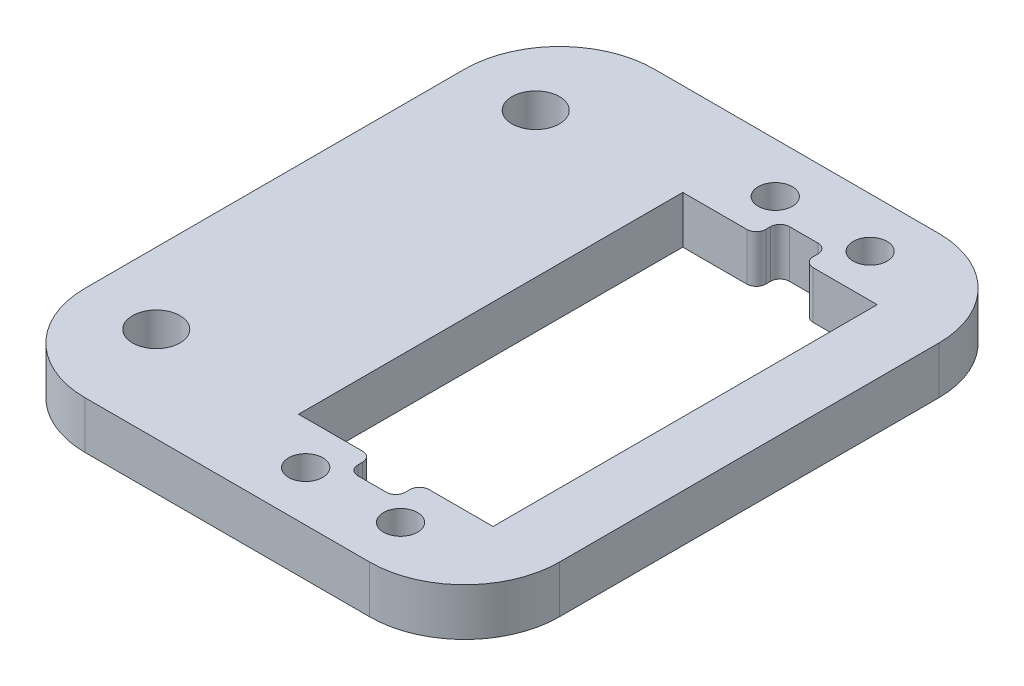
ISO-10303-21;
HEADER;
FILE_DESCRIPTION(('STEP AP214'),'2;1');
FILE_NAME('part.step','',(''),(''),'','','');
FILE_SCHEMA(('AUTOMOTIVE_DESIGN { 1 0 10303 214 1 1 1 1 }'));
ENDSEC;
DATA;
#1=APPLICATION_CONTEXT('core data for automotive mechanical design processes');
#2=APPLICATION_PROTOCOL_DEFINITION('international standard','automotive_design',2000,#1);
#3=PRODUCT_CONTEXT('',#1,'mechanical');
#4=PRODUCT('Part','Part','',(#3));
#5=PRODUCT_RELATED_PRODUCT_CATEGORY('part','',(#4));
#6=PRODUCT_DEFINITION_FORMATION('','',#4);
#7=PRODUCT_DEFINITION_CONTEXT('part definition',#1,'design');
#8=PRODUCT_DEFINITION('design','',#6,#7);
#9=PRODUCT_DEFINITION_SHAPE('','',#8);
#10=(LENGTH_UNIT() NAMED_UNIT(*) SI_UNIT(.MILLI.,.METRE.));
#11=(NAMED_UNIT(*) PLANE_ANGLE_UNIT() SI_UNIT($,.RADIAN.));
#12=(NAMED_UNIT(*) SI_UNIT($,.STERADIAN.) SOLID_ANGLE_UNIT());
#13=UNCERTAINTY_MEASURE_WITH_UNIT(LENGTH_MEASURE(1.E-05),#10,'distance_accuracy_value','');
#14=(GEOMETRIC_REPRESENTATION_CONTEXT(3) GLOBAL_UNCERTAINTY_ASSIGNED_CONTEXT((#13)) GLOBAL_UNIT_ASSIGNED_CONTEXT((#10,
#11,#12)) REPRESENTATION_CONTEXT('',''));
#15=CARTESIAN_POINT('',(0.,0.,0.));
#16=DIRECTION('',(0.,0.,1.));
#17=DIRECTION('',(1.,0.,0.));
#18=AXIS2_PLACEMENT_3D('',#15,#16,#17);
#19=CARTESIAN_POINT('',(0.,5.,0.));
#20=DIRECTION('',(0.,1.,0.));
#21=DIRECTION('',(0.,0.,1.));
#22=AXIS2_PLACEMENT_3D('',#19,#20,#21);
#23=PLANE('',#22);
#24=CARTESIAN_POINT('',(-17.5,5.,-20.));
#25=DIRECTION('',(0.,1.,0.));
#26=DIRECTION('',(0.,0.,1.));
#27=AXIS2_PLACEMENT_3D('',#24,#25,#26);
#28=CIRCLE('',#27,2.5);
#29=CARTESIAN_POINT('',(-17.5,5.,-17.5));
#30=VERTEX_POINT('',#29);
#31=EDGE_CURVE('E435',#30,#30,#28,.T.);
#32=ORIENTED_EDGE('',*,*,#31,.F.);
#33=EDGE_LOOP('',(#32));
#34=FACE_BOUND('',#33,.T.);
#35=CARTESIAN_POINT('',(-17.5,5.,20.));
#36=DIRECTION('',(0.,1.,0.));
#37=DIRECTION('',(0.,0.,1.));
#38=AXIS2_PLACEMENT_3D('',#35,#36,#37);
#39=CIRCLE('',#38,2.5);
#40=CARTESIAN_POINT('',(-17.5,5.,22.5));
#41=VERTEX_POINT('',#40);
#42=EDGE_CURVE('E423',#41,#41,#39,.T.);
#43=ORIENTED_EDGE('',*,*,#42,.F.);
#44=EDGE_LOOP('',(#43));
#45=FACE_BOUND('',#44,.T.);
#46=CARTESIAN_POINT('',(3.,5.,24.75));
#47=DIRECTION('',(0.,1.,0.));
#48=DIRECTION('',(0.,0.,-1.));
#49=AXIS2_PLACEMENT_3D('',#46,#47,#48);
#50=CIRCLE('',#49,1.8);
#51=CARTESIAN_POINT('',(3.,5.,22.95));
#52=VERTEX_POINT('',#51);
#53=EDGE_CURVE('E434',#52,#52,#50,.T.);
#54=ORIENTED_EDGE('',*,*,#53,.F.);
#55=EDGE_LOOP('',(#54));
#56=FACE_BOUND('',#55,.T.);
#57=CARTESIAN_POINT('',(13.,5.,24.75));
#58=DIRECTION('',(0.,1.,0.));
#59=DIRECTION('',(0.,0.,-1.));
#60=AXIS2_PLACEMENT_3D('',#57,#58,#59);
#61=CIRCLE('',#60,1.8);
#62=CARTESIAN_POINT('',(13.,5.,22.95));
#63=VERTEX_POINT('',#62);
#64=EDGE_CURVE('E449',#63,#63,#61,.T.);
#65=ORIENTED_EDGE('',*,*,#64,.F.);
#66=EDGE_LOOP('',(#65));
#67=FACE_BOUND('',#66,.T.);
#68=CARTESIAN_POINT('',(13.,5.,-24.75));
#69=DIRECTION('',(0.,1.,0.));
#70=DIRECTION('',(0.,0.,1.));
#71=AXIS2_PLACEMENT_3D('',#68,#69,#70);
#72=CIRCLE('',#71,1.8);
#73=CARTESIAN_POINT('',(13.,5.,-22.95));
#74=VERTEX_POINT('',#73);
#75=EDGE_CURVE('E443',#74,#74,#72,.T.);
#76=ORIENTED_EDGE('',*,*,#75,.F.);
#77=EDGE_LOOP('',(#76));
#78=FACE_BOUND('',#77,.T.);
#79=CARTESIAN_POINT('',(3.,5.,-24.75));
#80=DIRECTION('',(0.,1.,0.));
#81=DIRECTION('',(0.,0.,1.));
#82=AXIS2_PLACEMENT_3D('',#79,#80,#81);
#83=CIRCLE('',#82,1.8);
#84=CARTESIAN_POINT('',(3.,5.,-22.95));
#85=VERTEX_POINT('',#84);
#86=EDGE_CURVE('E251',#85,#85,#83,.T.);
#87=ORIENTED_EDGE('',*,*,#86,.F.);
#88=EDGE_LOOP('',(#87));
#89=FACE_BOUND('',#88,.T.);
#90=DIRECTION('',(1.,0.,0.));
#91=VECTOR('',#90,1.);
#92=CARTESIAN_POINT('',(25.,5.,30.));
#93=LINE('',#92,#91);
#94=CARTESIAN_POINT('',(-15.,5.,30.));
#95=VERTEX_POINT('',#94);
#96=CARTESIAN_POINT('',(15.,5.,30.));
#97=VERTEX_POINT('',#96);
#98=EDGE_CURVE('E276',#95,#97,#93,.T.);
#99=ORIENTED_EDGE('',*,*,#98,.T.);
#100=CARTESIAN_POINT('',(15.,5.,20.));
#101=DIRECTION('',(0.,1.,0.));
#102=DIRECTION('',(0.,0.,1.));
#103=AXIS2_PLACEMENT_3D('',#100,#101,#102);
#104=CIRCLE('',#103,10.);
#105=CARTESIAN_POINT('',(25.,5.,20.));
#106=VERTEX_POINT('',#105);
#107=EDGE_CURVE('E320',#97,#106,#104,.T.);
#108=ORIENTED_EDGE('',*,*,#107,.T.);
#109=DIRECTION('',(0.,0.,-1.));
#110=VECTOR('',#109,1.);
#111=CARTESIAN_POINT('',(25.,5.,30.));
#112=LINE('',#111,#110);
#113=CARTESIAN_POINT('',(25.,5.,-20.));
#114=VERTEX_POINT('',#113);
#115=EDGE_CURVE('E280',#106,#114,#112,.T.);
#116=ORIENTED_EDGE('',*,*,#115,.T.);
#117=CARTESIAN_POINT('',(15.,5.,-20.));
#118=DIRECTION('',(0.,1.,0.));
#119=DIRECTION('',(0.,0.,1.));
#120=AXIS2_PLACEMENT_3D('',#117,#118,#119);
#121=CIRCLE('',#120,10.);
#122=CARTESIAN_POINT('',(15.,5.,-30.));
#123=VERTEX_POINT('',#122);
#124=EDGE_CURVE('E314',#114,#123,#121,.T.);
#125=ORIENTED_EDGE('',*,*,#124,.T.);
#126=DIRECTION('',(-1.,0.,0.));
#127=VECTOR('',#126,1.);
#128=CARTESIAN_POINT('',(25.,5.,-30.));
#129=LINE('',#128,#127);
#130=CARTESIAN_POINT('',(-15.,5.,-30.));
#131=VERTEX_POINT('',#130);
#132=EDGE_CURVE('E283',#123,#131,#129,.T.);
#133=ORIENTED_EDGE('',*,*,#132,.T.);
#134=CARTESIAN_POINT('',(-15.,5.,-20.));
#135=DIRECTION('',(0.,1.,0.));
#136=DIRECTION('',(0.,0.,1.));
#137=AXIS2_PLACEMENT_3D('',#134,#135,#136);
#138=CIRCLE('',#137,10.);
#139=CARTESIAN_POINT('',(-25.,5.,-20.));
#140=VERTEX_POINT('',#139);
#141=EDGE_CURVE('E316',#131,#140,#138,.T.);
#142=ORIENTED_EDGE('',*,*,#141,.T.);
#143=DIRECTION('',(0.,0.,1.));
#144=VECTOR('',#143,1.);
#145=CARTESIAN_POINT('',(-25.,5.,30.));
#146=LINE('',#145,#144);
#147=CARTESIAN_POINT('',(-25.,5.,20.));
#148=VERTEX_POINT('',#147);
#149=EDGE_CURVE('E273',#140,#148,#146,.T.);
#150=ORIENTED_EDGE('',*,*,#149,.T.);
#151=CARTESIAN_POINT('',(-15.,5.,20.));
#152=DIRECTION('',(0.,1.,0.));
#153=DIRECTION('',(0.,0.,1.));
#154=AXIS2_PLACEMENT_3D('',#151,#152,#153);
#155=CIRCLE('',#154,10.);
#156=EDGE_CURVE('E318',#148,#95,#155,.T.);
#157=ORIENTED_EDGE('',*,*,#156,.T.);
#158=EDGE_LOOP('',(#99,#108,#116,#125,#133,#142,#150,#157));
#159=FACE_BOUND('',#158,.T.);
#160=DIRECTION('',(0.,0.,-1.));
#161=VECTOR('',#160,1.);
#162=CARTESIAN_POINT('',(5.5,5.,17.75));
#163=LINE('',#162,#161);
#164=CARTESIAN_POINT('',(5.5,5.,21.75));
#165=VERTEX_POINT('',#164);
#166=CARTESIAN_POINT('',(5.5,5.,21.25));
#167=VERTEX_POINT('',#166);
#168=EDGE_CURVE('E612',#165,#167,#163,.T.);
#169=ORIENTED_EDGE('',*,*,#168,.T.);
#170=CARTESIAN_POINT('',(4.5,5.,21.25));
#171=DIRECTION('',(0.,1.,0.));
#172=DIRECTION('',(0.,0.,1.));
#173=AXIS2_PLACEMENT_3D('',#170,#171,#172);
#174=CIRCLE('',#173,1.);
#175=CARTESIAN_POINT('',(4.5,5.,20.25));
#176=VERTEX_POINT('',#175);
#177=EDGE_CURVE('E349',#167,#176,#174,.T.);
#178=ORIENTED_EDGE('',*,*,#177,.T.);
#179=DIRECTION('',(1.,0.,0.));
#180=VECTOR('',#179,1.);
#181=CARTESIAN_POINT('',(18.25,5.,20.25));
#182=LINE('',#181,#180);
#183=CARTESIAN_POINT('',(-2.25,5.,20.25));
#184=VERTEX_POINT('',#183);
#185=EDGE_CURVE('E261',#184,#176,#182,.T.);
#186=ORIENTED_EDGE('',*,*,#185,.F.);
#187=DIRECTION('',(0.,0.,1.));
#188=VECTOR('',#187,1.);
#189=CARTESIAN_POINT('',(-2.25,5.,20.25));
#190=LINE('',#189,#188);
#191=CARTESIAN_POINT('',(-2.25,5.,-20.25));
#192=VERTEX_POINT('',#191);
#193=EDGE_CURVE('E226',#192,#184,#190,.T.);
#194=ORIENTED_EDGE('',*,*,#193,.F.);
#195=DIRECTION('',(-1.,0.,0.));
#196=VECTOR('',#195,1.);
#197=CARTESIAN_POINT('',(18.25,5.,-20.25));
#198=LINE('',#197,#196);
#199=CARTESIAN_POINT('',(4.5,5.,-20.25));
#200=VERTEX_POINT('',#199);
#201=EDGE_CURVE('E248',#200,#192,#198,.T.);
#202=ORIENTED_EDGE('',*,*,#201,.F.);
#203=CARTESIAN_POINT('',(4.5,5.,-21.25));
#204=DIRECTION('',(0.,1.,0.));
#205=DIRECTION('',(0.,0.,1.));
#206=AXIS2_PLACEMENT_3D('',#203,#204,#205);
#207=CIRCLE('',#206,1.);
#208=CARTESIAN_POINT('',(5.5,5.,-21.25));
#209=VERTEX_POINT('',#208);
#210=EDGE_CURVE('E343',#200,#209,#207,.T.);
#211=ORIENTED_EDGE('',*,*,#210,.T.);
#212=DIRECTION('',(0.,0.,1.));
#213=VECTOR('',#212,1.);
#214=CARTESIAN_POINT('',(5.5,5.,-17.75));
#215=LINE('',#214,#213);
#216=CARTESIAN_POINT('',(5.5,5.,-21.75));
#217=VERTEX_POINT('',#216);
#218=EDGE_CURVE('E408',#217,#209,#215,.T.);
#219=ORIENTED_EDGE('',*,*,#218,.F.);
#220=CARTESIAN_POINT('',(6.5,5.,-21.75));
#221=DIRECTION('',(0.,1.,0.));
#222=DIRECTION('',(0.,0.,1.));
#223=AXIS2_PLACEMENT_3D('',#220,#221,#222);
#224=CIRCLE('',#223,1.);
#225=CARTESIAN_POINT('',(6.5,5.,-22.75));
#226=VERTEX_POINT('',#225);
#227=EDGE_CURVE('E41',#217,#226,#224,.F.);
#228=ORIENTED_EDGE('',*,*,#227,.T.);
#229=DIRECTION('',(-1.,0.,0.));
#230=VECTOR('',#229,1.);
#231=CARTESIAN_POINT('',(10.5,5.,-22.75));
#232=LINE('',#231,#230);
#233=CARTESIAN_POINT('',(9.5,5.,-22.75));
#234=VERTEX_POINT('',#233);
#235=EDGE_CURVE('E407',#234,#226,#232,.T.);
#236=ORIENTED_EDGE('',*,*,#235,.F.);
#237=CARTESIAN_POINT('',(9.5,5.,-21.75));
#238=DIRECTION('',(0.,1.,0.));
#239=DIRECTION('',(0.,0.,1.));
#240=AXIS2_PLACEMENT_3D('',#237,#238,#239);
#241=CIRCLE('',#240,1.);
#242=CARTESIAN_POINT('',(10.5,5.,-21.75));
#243=VERTEX_POINT('',#242);
#244=EDGE_CURVE('E399',#234,#243,#241,.F.);
#245=ORIENTED_EDGE('',*,*,#244,.T.);
#246=DIRECTION('',(0.,0.,-1.));
#247=VECTOR('',#246,1.);
#248=CARTESIAN_POINT('',(10.5,5.,-17.75));
#249=LINE('',#248,#247);
#250=CARTESIAN_POINT('',(10.5,5.,-21.25));
#251=VERTEX_POINT('',#250);
#252=EDGE_CURVE('E417',#251,#243,#249,.T.);
#253=ORIENTED_EDGE('',*,*,#252,.F.);
#254=CARTESIAN_POINT('',(11.5,5.,-21.25));
#255=DIRECTION('',(0.,1.,0.));
#256=DIRECTION('',(0.,0.,1.));
#257=AXIS2_PLACEMENT_3D('',#254,#255,#256);
#258=CIRCLE('',#257,1.);
#259=CARTESIAN_POINT('',(11.5,5.,-20.25));
#260=VERTEX_POINT('',#259);
#261=EDGE_CURVE('E345',#251,#260,#258,.T.);
#262=ORIENTED_EDGE('',*,*,#261,.T.);
#263=CARTESIAN_POINT('',(18.25,5.,-20.25));
#264=VERTEX_POINT('',#263);
#265=EDGE_CURVE('E245',#264,#260,#198,.T.);
#266=ORIENTED_EDGE('',*,*,#265,.F.);
#267=DIRECTION('',(0.,0.,-1.));
#268=VECTOR('',#267,1.);
#269=CARTESIAN_POINT('',(18.25,5.,20.25));
#270=LINE('',#269,#268);
#271=CARTESIAN_POINT('',(18.25,5.,20.25));
#272=VERTEX_POINT('',#271);
#273=EDGE_CURVE('E263',#272,#264,#270,.T.);
#274=ORIENTED_EDGE('',*,*,#273,.F.);
#275=CARTESIAN_POINT('',(11.5,5.,20.25));
#276=VERTEX_POINT('',#275);
#277=EDGE_CURVE('E259',#276,#272,#182,.T.);
#278=ORIENTED_EDGE('',*,*,#277,.F.);
#279=CARTESIAN_POINT('',(11.5,5.,21.25));
#280=DIRECTION('',(0.,1.,0.));
#281=DIRECTION('',(0.,0.,1.));
#282=AXIS2_PLACEMENT_3D('',#279,#280,#281);
#283=CIRCLE('',#282,1.);
#284=CARTESIAN_POINT('',(10.5,5.,21.25));
#285=VERTEX_POINT('',#284);
#286=EDGE_CURVE('E347',#276,#285,#283,.T.);
#287=ORIENTED_EDGE('',*,*,#286,.T.);
#288=DIRECTION('',(0.,0.,1.));
#289=VECTOR('',#288,1.);
#290=CARTESIAN_POINT('',(10.5,5.,17.75));
#291=LINE('',#290,#289);
#292=CARTESIAN_POINT('',(10.5,5.,21.75));
#293=VERTEX_POINT('',#292);
#294=EDGE_CURVE('E572',#285,#293,#291,.T.);
#295=ORIENTED_EDGE('',*,*,#294,.T.);
#296=CARTESIAN_POINT('',(9.5,5.,21.75));
#297=DIRECTION('',(0.,1.,0.));
#298=DIRECTION('',(0.,0.,1.));
#299=AXIS2_PLACEMENT_3D('',#296,#297,#298);
#300=CIRCLE('',#299,1.);
#301=CARTESIAN_POINT('',(9.5,5.,22.75));
#302=VERTEX_POINT('',#301);
#303=EDGE_CURVE('E391',#293,#302,#300,.F.);
#304=ORIENTED_EDGE('',*,*,#303,.T.);
#305=DIRECTION('',(-1.,0.,0.));
#306=VECTOR('',#305,1.);
#307=CARTESIAN_POINT('',(10.5,5.,22.75));
#308=LINE('',#307,#306);
#309=CARTESIAN_POINT('',(6.5,5.,22.75));
#310=VERTEX_POINT('',#309);
#311=EDGE_CURVE('E611',#302,#310,#308,.T.);
#312=ORIENTED_EDGE('',*,*,#311,.T.);
#313=CARTESIAN_POINT('',(6.5,5.,21.75));
#314=DIRECTION('',(0.,1.,0.));
#315=DIRECTION('',(0.,0.,1.));
#316=AXIS2_PLACEMENT_3D('',#313,#314,#315);
#317=CIRCLE('',#316,1.);
#318=EDGE_CURVE('E395',#310,#165,#317,.F.);
#319=ORIENTED_EDGE('',*,*,#318,.T.);
#320=EDGE_LOOP('',(#169,#178,#186,#194,#202,#211,#219,#228,#236,#245,#253,#262,#266,#274,#278,
#287,#295,#304,#312,#319));
#321=FACE_BOUND('',#320,.T.);
#322=ADVANCED_FACE('F33',(#34,#45,#56,#67,#78,#89,#159,#321),#23,.T.);
#323=CARTESIAN_POINT('',(0.,0.,0.));
#324=DIRECTION('',(0.,1.,0.));
#325=DIRECTION('',(0.,0.,1.));
#326=AXIS2_PLACEMENT_3D('',#323,#324,#325);
#327=PLANE('',#326);
#328=DIRECTION('',(0.,0.,-1.));
#329=VECTOR('',#328,1.);
#330=CARTESIAN_POINT('',(25.,0.,30.));
#331=LINE('',#330,#329);
#332=CARTESIAN_POINT('',(25.,0.,20.));
#333=VERTEX_POINT('',#332);
#334=CARTESIAN_POINT('',(25.,0.,-20.));
#335=VERTEX_POINT('',#334);
#336=EDGE_CURVE('E292',#333,#335,#331,.T.);
#337=ORIENTED_EDGE('',*,*,#336,.F.);
#338=CARTESIAN_POINT('',(15.,0.,20.));
#339=DIRECTION('',(0.,1.,0.));
#340=DIRECTION('',(0.,0.,1.));
#341=AXIS2_PLACEMENT_3D('',#338,#339,#340);
#342=CIRCLE('',#341,10.);
#343=CARTESIAN_POINT('',(15.,0.,30.));
#344=VERTEX_POINT('',#343);
#345=EDGE_CURVE('E307',#333,#344,#342,.F.);
#346=ORIENTED_EDGE('',*,*,#345,.T.);
#347=DIRECTION('',(1.,0.,0.));
#348=VECTOR('',#347,1.);
#349=CARTESIAN_POINT('',(25.,0.,30.));
#350=LINE('',#349,#348);
#351=CARTESIAN_POINT('',(-15.,0.,30.));
#352=VERTEX_POINT('',#351);
#353=EDGE_CURVE('E289',#352,#344,#350,.T.);
#354=ORIENTED_EDGE('',*,*,#353,.F.);
#355=CARTESIAN_POINT('',(-15.,0.,20.));
#356=DIRECTION('',(0.,1.,0.));
#357=DIRECTION('',(0.,0.,1.));
#358=AXIS2_PLACEMENT_3D('',#355,#356,#357);
#359=CIRCLE('',#358,10.);
#360=CARTESIAN_POINT('',(-25.,0.,20.));
#361=VERTEX_POINT('',#360);
#362=EDGE_CURVE('E305',#352,#361,#359,.F.);
#363=ORIENTED_EDGE('',*,*,#362,.T.);
#364=DIRECTION('',(0.,0.,1.));
#365=VECTOR('',#364,1.);
#366=CARTESIAN_POINT('',(-25.,0.,30.));
#367=LINE('',#366,#365);
#368=CARTESIAN_POINT('',(-25.,0.,-20.));
#369=VERTEX_POINT('',#368);
#370=EDGE_CURVE('E268',#369,#361,#367,.T.);
#371=ORIENTED_EDGE('',*,*,#370,.F.);
#372=CARTESIAN_POINT('',(-15.,0.,-20.));
#373=DIRECTION('',(0.,1.,0.));
#374=DIRECTION('',(0.,0.,1.));
#375=AXIS2_PLACEMENT_3D('',#372,#373,#374);
#376=CIRCLE('',#375,10.);
#377=CARTESIAN_POINT('',(-15.,0.,-30.));
#378=VERTEX_POINT('',#377);
#379=EDGE_CURVE('E303',#369,#378,#376,.F.);
#380=ORIENTED_EDGE('',*,*,#379,.T.);
#381=DIRECTION('',(-1.,0.,0.));
#382=VECTOR('',#381,1.);
#383=CARTESIAN_POINT('',(25.,0.,-30.));
#384=LINE('',#383,#382);
#385=CARTESIAN_POINT('',(15.,0.,-30.));
#386=VERTEX_POINT('',#385);
#387=EDGE_CURVE('E277',#386,#378,#384,.T.);
#388=ORIENTED_EDGE('',*,*,#387,.F.);
#389=CARTESIAN_POINT('',(15.,0.,-20.));
#390=DIRECTION('',(0.,1.,0.));
#391=DIRECTION('',(0.,0.,1.));
#392=AXIS2_PLACEMENT_3D('',#389,#390,#391);
#393=CIRCLE('',#392,10.);
#394=EDGE_CURVE('E301',#386,#335,#393,.F.);
#395=ORIENTED_EDGE('',*,*,#394,.T.);
#396=EDGE_LOOP('',(#337,#346,#354,#363,#371,#380,#388,#395));
#397=FACE_BOUND('',#396,.T.);
#398=CARTESIAN_POINT('',(3.,0.,-24.75));
#399=DIRECTION('',(0.,1.,0.));
#400=DIRECTION('',(0.,0.,1.));
#401=AXIS2_PLACEMENT_3D('',#398,#399,#400);
#402=CIRCLE('',#401,1.8);
#403=CARTESIAN_POINT('',(3.,0.,-22.95));
#404=VERTEX_POINT('',#403);
#405=EDGE_CURVE('E260',#404,#404,#402,.T.);
#406=ORIENTED_EDGE('',*,*,#405,.T.);
#407=EDGE_LOOP('',(#406));
#408=FACE_BOUND('',#407,.T.);
#409=CARTESIAN_POINT('',(13.,0.,-24.75));
#410=DIRECTION('',(0.,1.,0.));
#411=DIRECTION('',(0.,0.,1.));
#412=AXIS2_PLACEMENT_3D('',#409,#410,#411);
#413=CIRCLE('',#412,1.8);
#414=CARTESIAN_POINT('',(13.,0.,-22.95));
#415=VERTEX_POINT('',#414);
#416=EDGE_CURVE('E440',#415,#415,#413,.T.);
#417=ORIENTED_EDGE('',*,*,#416,.T.);
#418=EDGE_LOOP('',(#417));
#419=FACE_BOUND('',#418,.T.);
#420=CARTESIAN_POINT('',(13.,0.,24.75));
#421=DIRECTION('',(0.,1.,0.));
#422=DIRECTION('',(0.,0.,-1.));
#423=AXIS2_PLACEMENT_3D('',#420,#421,#422);
#424=CIRCLE('',#423,1.8);
#425=CARTESIAN_POINT('',(13.,0.,22.95));
#426=VERTEX_POINT('',#425);
#427=EDGE_CURVE('E446',#426,#426,#424,.T.);
#428=ORIENTED_EDGE('',*,*,#427,.T.);
#429=EDGE_LOOP('',(#428));
#430=FACE_BOUND('',#429,.T.);
#431=CARTESIAN_POINT('',(3.,0.,24.75));
#432=DIRECTION('',(0.,1.,0.));
#433=DIRECTION('',(0.,0.,-1.));
#434=AXIS2_PLACEMENT_3D('',#431,#432,#433);
#435=CIRCLE('',#434,1.8);
#436=CARTESIAN_POINT('',(3.,0.,22.95));
#437=VERTEX_POINT('',#436);
#438=EDGE_CURVE('E452',#437,#437,#435,.T.);
#439=ORIENTED_EDGE('',*,*,#438,.T.);
#440=EDGE_LOOP('',(#439));
#441=FACE_BOUND('',#440,.T.);
#442=CARTESIAN_POINT('',(-17.5,0.,20.));
#443=DIRECTION('',(0.,1.,0.));
#444=DIRECTION('',(0.,0.,1.));
#445=AXIS2_PLACEMENT_3D('',#442,#443,#444);
#446=CIRCLE('',#445,2.5);
#447=CARTESIAN_POINT('',(-17.5,0.,22.5));
#448=VERTEX_POINT('',#447);
#449=EDGE_CURVE('E426',#448,#448,#446,.T.);
#450=ORIENTED_EDGE('',*,*,#449,.T.);
#451=EDGE_LOOP('',(#450));
#452=FACE_BOUND('',#451,.T.);
#453=CARTESIAN_POINT('',(-17.5,0.,-20.));
#454=DIRECTION('',(0.,1.,0.));
#455=DIRECTION('',(0.,0.,1.));
#456=AXIS2_PLACEMENT_3D('',#453,#454,#455);
#457=CIRCLE('',#456,2.5);
#458=CARTESIAN_POINT('',(-17.5,0.,-17.5));
#459=VERTEX_POINT('',#458);
#460=EDGE_CURVE('E431',#459,#459,#457,.T.);
#461=ORIENTED_EDGE('',*,*,#460,.T.);
#462=EDGE_LOOP('',(#461));
#463=FACE_BOUND('',#462,.T.);
#464=DIRECTION('',(1.,0.,0.));
#465=VECTOR('',#464,1.);
#466=CARTESIAN_POINT('',(18.25,0.,20.25));
#467=LINE('',#466,#465);
#468=CARTESIAN_POINT('',(-2.25,0.,20.25));
#469=VERTEX_POINT('',#468);
#470=CARTESIAN_POINT('',(4.5,0.,20.25));
#471=VERTEX_POINT('',#470);
#472=EDGE_CURVE('E234',#469,#471,#467,.T.);
#473=ORIENTED_EDGE('',*,*,#472,.T.);
#474=CARTESIAN_POINT('',(4.5,0.,21.25));
#475=DIRECTION('',(0.,1.,0.));
#476=DIRECTION('',(0.,0.,1.));
#477=AXIS2_PLACEMENT_3D('',#474,#475,#476);
#478=CIRCLE('',#477,1.);
#479=CARTESIAN_POINT('',(5.5,0.,21.25));
#480=VERTEX_POINT('',#479);
#481=EDGE_CURVE('E357',#471,#480,#478,.F.);
#482=ORIENTED_EDGE('',*,*,#481,.T.);
#483=DIRECTION('',(0.,0.,-1.));
#484=VECTOR('',#483,1.);
#485=CARTESIAN_POINT('',(5.5,0.,0.));
#486=LINE('',#485,#484);
#487=CARTESIAN_POINT('',(5.5,0.,21.75));
#488=VERTEX_POINT('',#487);
#489=EDGE_CURVE('E562',#488,#480,#486,.T.);
#490=ORIENTED_EDGE('',*,*,#489,.F.);
#491=CARTESIAN_POINT('',(6.5,0.,21.75));
#492=DIRECTION('',(0.,1.,0.));
#493=DIRECTION('',(0.,0.,1.));
#494=AXIS2_PLACEMENT_3D('',#491,#492,#493);
#495=CIRCLE('',#494,1.);
#496=CARTESIAN_POINT('',(6.5,0.,22.75));
#497=VERTEX_POINT('',#496);
#498=EDGE_CURVE('E397',#488,#497,#495,.T.);
#499=ORIENTED_EDGE('',*,*,#498,.T.);
#500=DIRECTION('',(-1.,0.,0.));
#501=VECTOR('',#500,1.);
#502=CARTESIAN_POINT('',(0.,0.,22.75));
#503=LINE('',#502,#501);
#504=CARTESIAN_POINT('',(9.5,0.,22.75));
#505=VERTEX_POINT('',#504);
#506=EDGE_CURVE('E335',#505,#497,#503,.T.);
#507=ORIENTED_EDGE('',*,*,#506,.F.);
#508=CARTESIAN_POINT('',(9.5,0.,21.75));
#509=DIRECTION('',(0.,1.,0.));
#510=DIRECTION('',(0.,0.,1.));
#511=AXIS2_PLACEMENT_3D('',#508,#509,#510);
#512=CIRCLE('',#511,1.);
#513=CARTESIAN_POINT('',(10.5,0.,21.75));
#514=VERTEX_POINT('',#513);
#515=EDGE_CURVE('E393',#505,#514,#512,.T.);
#516=ORIENTED_EDGE('',*,*,#515,.T.);
#517=DIRECTION('',(0.,0.,1.));
#518=VECTOR('',#517,1.);
#519=CARTESIAN_POINT('',(10.5,0.,0.));
#520=LINE('',#519,#518);
#521=CARTESIAN_POINT('',(10.5,0.,21.25));
#522=VERTEX_POINT('',#521);
#523=EDGE_CURVE('E568',#522,#514,#520,.T.);
#524=ORIENTED_EDGE('',*,*,#523,.F.);
#525=CARTESIAN_POINT('',(11.5,0.,21.25));
#526=DIRECTION('',(0.,1.,0.));
#527=DIRECTION('',(0.,0.,1.));
#528=AXIS2_PLACEMENT_3D('',#525,#526,#527);
#529=CIRCLE('',#528,1.);
#530=CARTESIAN_POINT('',(11.5,0.,20.25));
#531=VERTEX_POINT('',#530);
#532=EDGE_CURVE('E355',#522,#531,#529,.F.);
#533=ORIENTED_EDGE('',*,*,#532,.T.);
#534=CARTESIAN_POINT('',(18.25,0.,20.25));
#535=VERTEX_POINT('',#534);
#536=EDGE_CURVE('E240',#531,#535,#467,.T.);
#537=ORIENTED_EDGE('',*,*,#536,.T.);
#538=DIRECTION('',(0.,0.,-1.));
#539=VECTOR('',#538,1.);
#540=CARTESIAN_POINT('',(18.25,0.,20.25));
#541=LINE('',#540,#539);
#542=CARTESIAN_POINT('',(18.25,0.,-20.25));
#543=VERTEX_POINT('',#542);
#544=EDGE_CURVE('E239',#535,#543,#541,.T.);
#545=ORIENTED_EDGE('',*,*,#544,.T.);
#546=DIRECTION('',(-1.,0.,0.));
#547=VECTOR('',#546,1.);
#548=CARTESIAN_POINT('',(18.25,0.,-20.25));
#549=LINE('',#548,#547);
#550=CARTESIAN_POINT('',(11.5,0.,-20.25));
#551=VERTEX_POINT('',#550);
#552=EDGE_CURVE('E231',#543,#551,#549,.T.);
#553=ORIENTED_EDGE('',*,*,#552,.T.);
#554=CARTESIAN_POINT('',(11.5,0.,-21.25));
#555=DIRECTION('',(0.,1.,0.));
#556=DIRECTION('',(0.,0.,1.));
#557=AXIS2_PLACEMENT_3D('',#554,#555,#556);
#558=CIRCLE('',#557,1.);
#559=CARTESIAN_POINT('',(10.5,0.,-21.25));
#560=VERTEX_POINT('',#559);
#561=EDGE_CURVE('E353',#551,#560,#558,.F.);
#562=ORIENTED_EDGE('',*,*,#561,.T.);
#563=DIRECTION('',(0.,0.,-1.));
#564=VECTOR('',#563,1.);
#565=CARTESIAN_POINT('',(10.5,0.,0.));
#566=LINE('',#565,#564);
#567=CARTESIAN_POINT('',(10.5,0.,-21.75));
#568=VERTEX_POINT('',#567);
#569=EDGE_CURVE('E416',#560,#568,#566,.T.);
#570=ORIENTED_EDGE('',*,*,#569,.T.);
#571=CARTESIAN_POINT('',(9.5,0.,-21.75));
#572=DIRECTION('',(0.,1.,0.));
#573=DIRECTION('',(0.,0.,1.));
#574=AXIS2_PLACEMENT_3D('',#571,#572,#573);
#575=CIRCLE('',#574,1.);
#576=CARTESIAN_POINT('',(9.5,0.,-22.75));
#577=VERTEX_POINT('',#576);
#578=EDGE_CURVE('E401',#568,#577,#575,.T.);
#579=ORIENTED_EDGE('',*,*,#578,.T.);
#580=DIRECTION('',(-1.,0.,0.));
#581=VECTOR('',#580,1.);
#582=CARTESIAN_POINT('',(0.,0.,-22.75));
#583=LINE('',#582,#581);
#584=CARTESIAN_POINT('',(6.5,0.,-22.75));
#585=VERTEX_POINT('',#584);
#586=EDGE_CURVE('E332',#577,#585,#583,.T.);
#587=ORIENTED_EDGE('',*,*,#586,.T.);
#588=CARTESIAN_POINT('',(6.5,0.,-21.75));
#589=DIRECTION('',(0.,1.,0.));
#590=DIRECTION('',(0.,0.,1.));
#591=AXIS2_PLACEMENT_3D('',#588,#589,#590);
#592=CIRCLE('',#591,1.);
#593=CARTESIAN_POINT('',(5.5,0.,-21.75));
#594=VERTEX_POINT('',#593);
#595=EDGE_CURVE('E11',#585,#594,#592,.T.);
#596=ORIENTED_EDGE('',*,*,#595,.T.);
#597=DIRECTION('',(0.,0.,1.));
#598=VECTOR('',#597,1.);
#599=CARTESIAN_POINT('',(5.5,0.,0.));
#600=LINE('',#599,#598);
#601=CARTESIAN_POINT('',(5.5,0.,-21.25));
#602=VERTEX_POINT('',#601);
#603=EDGE_CURVE('E421',#594,#602,#600,.T.);
#604=ORIENTED_EDGE('',*,*,#603,.T.);
#605=CARTESIAN_POINT('',(4.5,0.,-21.25));
#606=DIRECTION('',(0.,1.,0.));
#607=DIRECTION('',(0.,0.,1.));
#608=AXIS2_PLACEMENT_3D('',#605,#606,#607);
#609=CIRCLE('',#608,1.);
#610=CARTESIAN_POINT('',(4.5,0.,-20.25));
#611=VERTEX_POINT('',#610);
#612=EDGE_CURVE('E48',#602,#611,#609,.F.);
#613=ORIENTED_EDGE('',*,*,#612,.T.);
#614=CARTESIAN_POINT('',(-2.25,0.,-20.25));
#615=VERTEX_POINT('',#614);
#616=EDGE_CURVE('E243',#611,#615,#549,.T.);
#617=ORIENTED_EDGE('',*,*,#616,.T.);
#618=DIRECTION('',(0.,0.,1.));
#619=VECTOR('',#618,1.);
#620=CARTESIAN_POINT('',(-2.25,0.,20.25));
#621=LINE('',#620,#619);
#622=EDGE_CURVE('E224',#615,#469,#621,.T.);
#623=ORIENTED_EDGE('',*,*,#622,.T.);
#624=EDGE_LOOP('',(#473,#482,#490,#499,#507,#516,#524,#533,#537,#545,#553,#562,#570,#579,#587,
#596,#604,#613,#617,#623));
#625=FACE_BOUND('',#624,.T.);
#626=ADVANCED_FACE('F242',(#397,#408,#419,#430,#441,#452,#463,#625),#327,.F.);
#627=CARTESIAN_POINT('',(18.25,0.,20.25));
#628=DIRECTION('',(0.,0.,1.));
#629=DIRECTION('',(1.,0.,0.));
#630=AXIS2_PLACEMENT_3D('',#627,#628,#629);
#631=PLANE('',#630);
#632=ORIENTED_EDGE('',*,*,#185,.T.);
#633=DIRECTION('',(0.,1.,0.));
#634=VECTOR('',#633,1.);
#635=CARTESIAN_POINT('',(4.5,0.,20.25));
#636=LINE('',#635,#634);
#637=EDGE_CURVE('E237',#176,#471,#636,.F.);
#638=ORIENTED_EDGE('',*,*,#637,.T.);
#639=ORIENTED_EDGE('',*,*,#472,.F.);
#640=DIRECTION('',(0.,1.,0.));
#641=VECTOR('',#640,1.);
#642=CARTESIAN_POINT('',(-2.25,0.,20.25));
#643=LINE('',#642,#641);
#644=EDGE_CURVE('E219',#469,#184,#643,.T.);
#645=ORIENTED_EDGE('',*,*,#644,.T.);
#646=EDGE_LOOP('',(#632,#638,#639,#645));
#647=FACE_BOUND('',#646,.T.);
#648=ADVANCED_FACE('F235',(#647),#631,.F.);
#649=ORIENTED_EDGE('',*,*,#536,.F.);
#650=DIRECTION('',(0.,-1.,0.));
#651=VECTOR('',#650,1.);
#652=CARTESIAN_POINT('',(11.5,5.,20.25));
#653=LINE('',#652,#651);
#654=EDGE_CURVE('E365',#531,#276,#653,.F.);
#655=ORIENTED_EDGE('',*,*,#654,.T.);
#656=ORIENTED_EDGE('',*,*,#277,.T.);
#657=DIRECTION('',(0.,1.,0.));
#658=VECTOR('',#657,1.);
#659=CARTESIAN_POINT('',(18.25,0.,20.25));
#660=LINE('',#659,#658);
#661=EDGE_CURVE('E230',#535,#272,#660,.T.);
#662=ORIENTED_EDGE('',*,*,#661,.F.);
#663=EDGE_LOOP('',(#649,#655,#656,#662));
#664=FACE_BOUND('',#663,.T.);
#665=ADVANCED_FACE('F660',(#664),#631,.F.);
#666=CARTESIAN_POINT('',(18.25,0.,-20.25));
#667=DIRECTION('',(0.,0.,-1.));
#668=DIRECTION('',(-1.,0.,0.));
#669=AXIS2_PLACEMENT_3D('',#666,#667,#668);
#670=PLANE('',#669);
#671=ORIENTED_EDGE('',*,*,#616,.F.);
#672=DIRECTION('',(0.,1.,0.));
#673=VECTOR('',#672,1.);
#674=CARTESIAN_POINT('',(4.5,0.,-20.25));
#675=LINE('',#674,#673);
#676=EDGE_CURVE('E388',#611,#200,#675,.T.);
#677=ORIENTED_EDGE('',*,*,#676,.T.);
#678=ORIENTED_EDGE('',*,*,#201,.T.);
#679=DIRECTION('',(0.,1.,0.));
#680=VECTOR('',#679,1.);
#681=CARTESIAN_POINT('',(-2.25,0.,-20.25));
#682=LINE('',#681,#680);
#683=EDGE_CURVE('E266',#615,#192,#682,.T.);
#684=ORIENTED_EDGE('',*,*,#683,.F.);
#685=EDGE_LOOP('',(#671,#677,#678,#684));
#686=FACE_BOUND('',#685,.T.);
#687=ADVANCED_FACE('F512',(#686),#670,.F.);
#688=CARTESIAN_POINT('',(-25.,5.,30.));
#689=DIRECTION('',(1.,0.,0.));
#690=DIRECTION('',(0.,0.,-1.));
#691=AXIS2_PLACEMENT_3D('',#688,#689,#690);
#692=PLANE('',#691);
#693=ORIENTED_EDGE('',*,*,#370,.T.);
#694=DIRECTION('',(0.,-1.,0.));
#695=VECTOR('',#694,1.);
#696=CARTESIAN_POINT('',(-25.,5.,20.));
#697=LINE('',#696,#695);
#698=EDGE_CURVE('E325',#361,#148,#697,.F.);
#699=ORIENTED_EDGE('',*,*,#698,.T.);
#700=ORIENTED_EDGE('',*,*,#149,.F.);
#701=DIRECTION('',(0.,-1.,0.));
#702=VECTOR('',#701,1.);
#703=CARTESIAN_POINT('',(-25.,5.,-20.));
#704=LINE('',#703,#702);
#705=EDGE_CURVE('E322',#140,#369,#704,.T.);
#706=ORIENTED_EDGE('',*,*,#705,.T.);
#707=EDGE_LOOP('',(#693,#699,#700,#706));
#708=FACE_BOUND('',#707,.T.);
#709=ADVANCED_FACE('F500',(#708),#692,.F.);
#710=CARTESIAN_POINT('',(25.,5.,30.));
#711=DIRECTION('',(0.,0.,-1.));
#712=DIRECTION('',(-1.,0.,0.));
#713=AXIS2_PLACEMENT_3D('',#710,#711,#712);
#714=PLANE('',#713);
#715=ORIENTED_EDGE('',*,*,#353,.T.);
#716=DIRECTION('',(0.,-1.,0.));
#717=VECTOR('',#716,1.);
#718=CARTESIAN_POINT('',(15.,5.,30.));
#719=LINE('',#718,#717);
#720=EDGE_CURVE('E312',#344,#97,#719,.F.);
#721=ORIENTED_EDGE('',*,*,#720,.T.);
#722=ORIENTED_EDGE('',*,*,#98,.F.);
#723=DIRECTION('',(0.,-1.,0.));
#724=VECTOR('',#723,1.);
#725=CARTESIAN_POINT('',(-15.,5.,30.));
#726=LINE('',#725,#724);
#727=EDGE_CURVE('E309',#95,#352,#726,.T.);
#728=ORIENTED_EDGE('',*,*,#727,.T.);
#729=EDGE_LOOP('',(#715,#721,#722,#728));
#730=FACE_BOUND('',#729,.T.);
#731=ADVANCED_FACE('F504',(#730),#714,.F.);
#732=CARTESIAN_POINT('',(25.,5.,30.));
#733=DIRECTION('',(-1.,0.,0.));
#734=DIRECTION('',(0.,0.,1.));
#735=AXIS2_PLACEMENT_3D('',#732,#733,#734);
#736=PLANE('',#735);
#737=ORIENTED_EDGE('',*,*,#115,.F.);
#738=DIRECTION('',(0.,-1.,0.));
#739=VECTOR('',#738,1.);
#740=CARTESIAN_POINT('',(25.,5.,20.));
#741=LINE('',#740,#739);
#742=EDGE_CURVE('E298',#106,#333,#741,.T.);
#743=ORIENTED_EDGE('',*,*,#742,.T.);
#744=ORIENTED_EDGE('',*,*,#336,.T.);
#745=DIRECTION('',(0.,-1.,0.));
#746=VECTOR('',#745,1.);
#747=CARTESIAN_POINT('',(25.,5.,-20.));
#748=LINE('',#747,#746);
#749=EDGE_CURVE('E286',#335,#114,#748,.F.);
#750=ORIENTED_EDGE('',*,*,#749,.T.);
#751=EDGE_LOOP('',(#737,#743,#744,#750));
#752=FACE_BOUND('',#751,.T.);
#753=ADVANCED_FACE('F480',(#752),#736,.F.);
#754=CARTESIAN_POINT('',(25.,5.,-30.));
#755=DIRECTION('',(0.,0.,1.));
#756=DIRECTION('',(1.,0.,0.));
#757=AXIS2_PLACEMENT_3D('',#754,#755,#756);
#758=PLANE('',#757);
#759=ORIENTED_EDGE('',*,*,#387,.T.);
#760=DIRECTION('',(0.,-1.,0.));
#761=VECTOR('',#760,1.);
#762=CARTESIAN_POINT('',(-15.,5.,-30.));
#763=LINE('',#762,#761);
#764=EDGE_CURVE('E330',#378,#131,#763,.F.);
#765=ORIENTED_EDGE('',*,*,#764,.T.);
#766=ORIENTED_EDGE('',*,*,#132,.F.);
#767=DIRECTION('',(0.,-1.,0.));
#768=VECTOR('',#767,1.);
#769=CARTESIAN_POINT('',(15.,5.,-30.));
#770=LINE('',#769,#768);
#771=EDGE_CURVE('E327',#123,#386,#770,.T.);
#772=ORIENTED_EDGE('',*,*,#771,.T.);
#773=EDGE_LOOP('',(#759,#765,#766,#772));
#774=FACE_BOUND('',#773,.T.);
#775=ADVANCED_FACE('F491',(#774),#758,.F.);
#776=CARTESIAN_POINT('',(-2.25,0.,20.25));
#777=DIRECTION('',(-1.,0.,0.));
#778=DIRECTION('',(0.,0.,1.));
#779=AXIS2_PLACEMENT_3D('',#776,#777,#778);
#780=PLANE('',#779);
#781=ORIENTED_EDGE('',*,*,#193,.T.);
#782=ORIENTED_EDGE('',*,*,#644,.F.);
#783=ORIENTED_EDGE('',*,*,#622,.F.);
#784=ORIENTED_EDGE('',*,*,#683,.T.);
#785=EDGE_LOOP('',(#781,#782,#783,#784));
#786=FACE_BOUND('',#785,.T.);
#787=ADVANCED_FACE('F221',(#786),#780,.F.);
#788=ORIENTED_EDGE('',*,*,#265,.T.);
#789=DIRECTION('',(0.,-1.,0.));
#790=VECTOR('',#789,1.);
#791=CARTESIAN_POINT('',(11.5,0.,-20.25));
#792=LINE('',#791,#790);
#793=EDGE_CURVE('E372',#260,#551,#792,.T.);
#794=ORIENTED_EDGE('',*,*,#793,.T.);
#795=ORIENTED_EDGE('',*,*,#552,.F.);
#796=DIRECTION('',(0.,1.,0.));
#797=VECTOR('',#796,1.);
#798=CARTESIAN_POINT('',(18.25,0.,-20.25));
#799=LINE('',#798,#797);
#800=EDGE_CURVE('E269',#543,#264,#799,.T.);
#801=ORIENTED_EDGE('',*,*,#800,.T.);
#802=EDGE_LOOP('',(#788,#794,#795,#801));
#803=FACE_BOUND('',#802,.T.);
#804=ADVANCED_FACE('F589',(#803),#670,.F.);
#805=CARTESIAN_POINT('',(18.25,0.,20.25));
#806=DIRECTION('',(1.,0.,0.));
#807=DIRECTION('',(0.,0.,-1.));
#808=AXIS2_PLACEMENT_3D('',#805,#806,#807);
#809=PLANE('',#808);
#810=ORIENTED_EDGE('',*,*,#273,.T.);
#811=ORIENTED_EDGE('',*,*,#800,.F.);
#812=ORIENTED_EDGE('',*,*,#544,.F.);
#813=ORIENTED_EDGE('',*,*,#661,.T.);
#814=EDGE_LOOP('',(#810,#811,#812,#813));
#815=FACE_BOUND('',#814,.T.);
#816=ADVANCED_FACE('F593',(#815),#809,.F.);
#817=CARTESIAN_POINT('',(3.,0.,-24.75));
#818=DIRECTION('',(0.,1.,0.));
#819=DIRECTION('',(0.,0.,1.));
#820=AXIS2_PLACEMENT_3D('',#817,#818,#819);
#821=CYLINDRICAL_SURFACE('',#820,1.8);
#822=ORIENTED_EDGE('',*,*,#405,.F.);
#823=EDGE_LOOP('',(#822));
#824=FACE_BOUND('',#823,.T.);
#825=ORIENTED_EDGE('',*,*,#86,.T.);
#826=EDGE_LOOP('',(#825));
#827=FACE_BOUND('',#826,.T.);
#828=ADVANCED_FACE('F462',(#824,#827),#821,.F.);
#829=CARTESIAN_POINT('',(13.,0.,-24.75));
#830=DIRECTION('',(0.,1.,0.));
#831=DIRECTION('',(0.,0.,1.));
#832=AXIS2_PLACEMENT_3D('',#829,#830,#831);
#833=CYLINDRICAL_SURFACE('',#832,1.8);
#834=ORIENTED_EDGE('',*,*,#416,.F.);
#835=EDGE_LOOP('',(#834));
#836=FACE_BOUND('',#835,.T.);
#837=ORIENTED_EDGE('',*,*,#75,.T.);
#838=EDGE_LOOP('',(#837));
#839=FACE_BOUND('',#838,.T.);
#840=ADVANCED_FACE('F640',(#836,#839),#833,.F.);
#841=CARTESIAN_POINT('',(13.,0.,24.75));
#842=DIRECTION('',(0.,1.,0.));
#843=DIRECTION('',(0.,0.,1.));
#844=AXIS2_PLACEMENT_3D('',#841,#842,#843);
#845=CYLINDRICAL_SURFACE('',#844,1.8);
#846=ORIENTED_EDGE('',*,*,#427,.F.);
#847=EDGE_LOOP('',(#846));
#848=FACE_BOUND('',#847,.T.);
#849=ORIENTED_EDGE('',*,*,#64,.T.);
#850=EDGE_LOOP('',(#849));
#851=FACE_BOUND('',#850,.T.);
#852=ADVANCED_FACE('F643',(#848,#851),#845,.F.);
#853=CARTESIAN_POINT('',(3.,0.,24.75));
#854=DIRECTION('',(0.,1.,0.));
#855=DIRECTION('',(0.,0.,1.));
#856=AXIS2_PLACEMENT_3D('',#853,#854,#855);
#857=CYLINDRICAL_SURFACE('',#856,1.8);
#858=ORIENTED_EDGE('',*,*,#438,.F.);
#859=EDGE_LOOP('',(#858));
#860=FACE_BOUND('',#859,.T.);
#861=ORIENTED_EDGE('',*,*,#53,.T.);
#862=EDGE_LOOP('',(#861));
#863=FACE_BOUND('',#862,.T.);
#864=ADVANCED_FACE('F638',(#860,#863),#857,.F.);
#865=CARTESIAN_POINT('',(-17.5,0.,20.));
#866=DIRECTION('',(0.,1.,0.));
#867=DIRECTION('',(0.,0.,1.));
#868=AXIS2_PLACEMENT_3D('',#865,#866,#867);
#869=CYLINDRICAL_SURFACE('',#868,2.5);
#870=ORIENTED_EDGE('',*,*,#449,.F.);
#871=EDGE_LOOP('',(#870));
#872=FACE_BOUND('',#871,.T.);
#873=ORIENTED_EDGE('',*,*,#42,.T.);
#874=EDGE_LOOP('',(#873));
#875=FACE_BOUND('',#874,.T.);
#876=ADVANCED_FACE('F634',(#872,#875),#869,.F.);
#877=CARTESIAN_POINT('',(-17.5,0.,-20.));
#878=DIRECTION('',(0.,1.,0.));
#879=DIRECTION('',(0.,0.,1.));
#880=AXIS2_PLACEMENT_3D('',#877,#878,#879);
#881=CYLINDRICAL_SURFACE('',#880,2.5);
#882=ORIENTED_EDGE('',*,*,#460,.F.);
#883=EDGE_LOOP('',(#882));
#884=FACE_BOUND('',#883,.T.);
#885=ORIENTED_EDGE('',*,*,#31,.T.);
#886=EDGE_LOOP('',(#885));
#887=FACE_BOUND('',#886,.T.);
#888=ADVANCED_FACE('F518',(#884,#887),#881,.F.);
#889=CARTESIAN_POINT('',(15.,5.,20.));
#890=DIRECTION('',(0.,-1.,0.));
#891=DIRECTION('',(0.,0.,-1.));
#892=AXIS2_PLACEMENT_3D('',#889,#890,#891);
#893=CYLINDRICAL_SURFACE('',#892,10.);
#894=ORIENTED_EDGE('',*,*,#107,.F.);
#895=ORIENTED_EDGE('',*,*,#720,.F.);
#896=ORIENTED_EDGE('',*,*,#345,.F.);
#897=ORIENTED_EDGE('',*,*,#742,.F.);
#898=EDGE_LOOP('',(#894,#895,#896,#897));
#899=FACE_BOUND('',#898,.T.);
#900=ADVANCED_FACE('F477',(#899),#893,.T.);
#901=CARTESIAN_POINT('',(-15.,5.,20.));
#902=DIRECTION('',(0.,-1.,0.));
#903=DIRECTION('',(0.,0.,-1.));
#904=AXIS2_PLACEMENT_3D('',#901,#902,#903);
#905=CYLINDRICAL_SURFACE('',#904,10.);
#906=ORIENTED_EDGE('',*,*,#156,.F.);
#907=ORIENTED_EDGE('',*,*,#698,.F.);
#908=ORIENTED_EDGE('',*,*,#362,.F.);
#909=ORIENTED_EDGE('',*,*,#727,.F.);
#910=EDGE_LOOP('',(#906,#907,#908,#909));
#911=FACE_BOUND('',#910,.T.);
#912=ADVANCED_FACE('F503',(#911),#905,.T.);
#913=CARTESIAN_POINT('',(-15.,5.,-20.));
#914=DIRECTION('',(0.,-1.,0.));
#915=DIRECTION('',(0.,0.,-1.));
#916=AXIS2_PLACEMENT_3D('',#913,#914,#915);
#917=CYLINDRICAL_SURFACE('',#916,10.);
#918=ORIENTED_EDGE('',*,*,#141,.F.);
#919=ORIENTED_EDGE('',*,*,#764,.F.);
#920=ORIENTED_EDGE('',*,*,#379,.F.);
#921=ORIENTED_EDGE('',*,*,#705,.F.);
#922=EDGE_LOOP('',(#918,#919,#920,#921));
#923=FACE_BOUND('',#922,.T.);
#924=ADVANCED_FACE('F497',(#923),#917,.T.);
#925=CARTESIAN_POINT('',(15.,5.,-20.));
#926=DIRECTION('',(0.,-1.,0.));
#927=DIRECTION('',(0.,0.,-1.));
#928=AXIS2_PLACEMENT_3D('',#925,#926,#927);
#929=CYLINDRICAL_SURFACE('',#928,10.);
#930=ORIENTED_EDGE('',*,*,#124,.F.);
#931=ORIENTED_EDGE('',*,*,#749,.F.);
#932=ORIENTED_EDGE('',*,*,#394,.F.);
#933=ORIENTED_EDGE('',*,*,#771,.F.);
#934=EDGE_LOOP('',(#930,#931,#932,#933));
#935=FACE_BOUND('',#934,.T.);
#936=ADVANCED_FACE('F488',(#935),#929,.T.);
#937=CARTESIAN_POINT('',(10.5,-5.,-22.75));
#938=DIRECTION('',(0.,0.,-1.));
#939=DIRECTION('',(-1.,0.,0.));
#940=AXIS2_PLACEMENT_3D('',#937,#938,#939);
#941=PLANE('',#940);
#942=ORIENTED_EDGE('',*,*,#586,.F.);
#943=DIRECTION('',(0.,1.,0.));
#944=VECTOR('',#943,1.);
#945=CARTESIAN_POINT('',(9.5,5.,-22.75));
#946=LINE('',#945,#944);
#947=EDGE_CURVE('E381',#577,#234,#946,.T.);
#948=ORIENTED_EDGE('',*,*,#947,.T.);
#949=ORIENTED_EDGE('',*,*,#235,.T.);
#950=DIRECTION('',(0.,1.,0.));
#951=VECTOR('',#950,1.);
#952=CARTESIAN_POINT('',(6.5,0.,-22.75));
#953=LINE('',#952,#951);
#954=EDGE_CURVE('E379',#226,#585,#953,.F.);
#955=ORIENTED_EDGE('',*,*,#954,.T.);
#956=EDGE_LOOP('',(#942,#948,#949,#955));
#957=FACE_BOUND('',#956,.T.);
#958=ADVANCED_FACE('F414',(#957),#941,.F.);
#959=CARTESIAN_POINT('',(5.5,-5.,-17.75));
#960=DIRECTION('',(-1.,0.,0.));
#961=DIRECTION('',(0.,0.,1.));
#962=AXIS2_PLACEMENT_3D('',#959,#960,#961);
#963=PLANE('',#962);
#964=ORIENTED_EDGE('',*,*,#603,.F.);
#965=DIRECTION('',(0.,1.,0.));
#966=VECTOR('',#965,1.);
#967=CARTESIAN_POINT('',(5.5,5.,-21.75));
#968=LINE('',#967,#966);
#969=EDGE_CURVE('E385',#594,#217,#968,.T.);
#970=ORIENTED_EDGE('',*,*,#969,.T.);
#971=ORIENTED_EDGE('',*,*,#218,.T.);
#972=DIRECTION('',(0.,1.,0.));
#973=VECTOR('',#972,1.);
#974=CARTESIAN_POINT('',(5.5,-5.,-21.25));
#975=LINE('',#974,#973);
#976=EDGE_CURVE('E56',#209,#602,#975,.F.);
#977=ORIENTED_EDGE('',*,*,#976,.T.);
#978=EDGE_LOOP('',(#964,#970,#971,#977));
#979=FACE_BOUND('',#978,.T.);
#980=ADVANCED_FACE('F422',(#979),#963,.F.);
#981=CARTESIAN_POINT('',(10.5,-5.,-17.75));
#982=DIRECTION('',(1.,0.,0.));
#983=DIRECTION('',(0.,0.,-1.));
#984=AXIS2_PLACEMENT_3D('',#981,#982,#983);
#985=PLANE('',#984);
#986=ORIENTED_EDGE('',*,*,#569,.F.);
#987=DIRECTION('',(0.,-1.,0.));
#988=VECTOR('',#987,1.);
#989=CARTESIAN_POINT('',(10.5,-5.,-21.25));
#990=LINE('',#989,#988);
#991=EDGE_CURVE('E377',#560,#251,#990,.F.);
#992=ORIENTED_EDGE('',*,*,#991,.T.);
#993=ORIENTED_EDGE('',*,*,#252,.T.);
#994=DIRECTION('',(0.,1.,0.));
#995=VECTOR('',#994,1.);
#996=CARTESIAN_POINT('',(10.5,0.,-21.75));
#997=LINE('',#996,#995);
#998=EDGE_CURVE('E375',#243,#568,#997,.F.);
#999=ORIENTED_EDGE('',*,*,#998,.T.);
#1000=EDGE_LOOP('',(#986,#992,#993,#999));
#1001=FACE_BOUND('',#1000,.T.);
#1002=ADVANCED_FACE('F581',(#1001),#985,.F.);
#1003=CARTESIAN_POINT('',(10.5,-5.,22.75));
#1004=DIRECTION('',(0.,0.,-1.));
#1005=DIRECTION('',(-1.,0.,0.));
#1006=AXIS2_PLACEMENT_3D('',#1003,#1004,#1005);
#1007=PLANE('',#1006);
#1008=ORIENTED_EDGE('',*,*,#311,.F.);
#1009=DIRECTION('',(0.,1.,0.));
#1010=VECTOR('',#1009,1.);
#1011=CARTESIAN_POINT('',(9.5,0.,22.75));
#1012=LINE('',#1011,#1010);
#1013=EDGE_CURVE('E370',#302,#505,#1012,.F.);
#1014=ORIENTED_EDGE('',*,*,#1013,.T.);
#1015=ORIENTED_EDGE('',*,*,#506,.T.);
#1016=DIRECTION('',(0.,1.,0.));
#1017=VECTOR('',#1016,1.);
#1018=CARTESIAN_POINT('',(6.5,5.,22.75));
#1019=LINE('',#1018,#1017);
#1020=EDGE_CURVE('E367',#497,#310,#1019,.T.);
#1021=ORIENTED_EDGE('',*,*,#1020,.T.);
#1022=EDGE_LOOP('',(#1008,#1014,#1015,#1021));
#1023=FACE_BOUND('',#1022,.T.);
#1024=ADVANCED_FACE('F617',(#1023),#1007,.T.);
#1025=CARTESIAN_POINT('',(5.5,-5.,17.75));
#1026=DIRECTION('',(1.,0.,0.));
#1027=DIRECTION('',(0.,0.,-1.));
#1028=AXIS2_PLACEMENT_3D('',#1025,#1026,#1027);
#1029=PLANE('',#1028);
#1030=ORIENTED_EDGE('',*,*,#489,.T.);
#1031=DIRECTION('',(0.,1.,0.));
#1032=VECTOR('',#1031,1.);
#1033=CARTESIAN_POINT('',(5.5,5.,21.25));
#1034=LINE('',#1033,#1032);
#1035=EDGE_CURVE('E340',#480,#167,#1034,.T.);
#1036=ORIENTED_EDGE('',*,*,#1035,.T.);
#1037=ORIENTED_EDGE('',*,*,#168,.F.);
#1038=DIRECTION('',(0.,1.,0.));
#1039=VECTOR('',#1038,1.);
#1040=CARTESIAN_POINT('',(5.5,0.,21.75));
#1041=LINE('',#1040,#1039);
#1042=EDGE_CURVE('E338',#165,#488,#1041,.F.);
#1043=ORIENTED_EDGE('',*,*,#1042,.T.);
#1044=EDGE_LOOP('',(#1030,#1036,#1037,#1043));
#1045=FACE_BOUND('',#1044,.T.);
#1046=ADVANCED_FACE('F565',(#1045),#1029,.T.);
#1047=CARTESIAN_POINT('',(10.5,-5.,17.75));
#1048=DIRECTION('',(-1.,0.,0.));
#1049=DIRECTION('',(0.,0.,1.));
#1050=AXIS2_PLACEMENT_3D('',#1047,#1048,#1049);
#1051=PLANE('',#1050);
#1052=ORIENTED_EDGE('',*,*,#294,.F.);
#1053=DIRECTION('',(0.,-1.,0.));
#1054=VECTOR('',#1053,1.);
#1055=CARTESIAN_POINT('',(10.5,0.,21.25));
#1056=LINE('',#1055,#1054);
#1057=EDGE_CURVE('E362',#285,#522,#1056,.T.);
#1058=ORIENTED_EDGE('',*,*,#1057,.T.);
#1059=ORIENTED_EDGE('',*,*,#523,.T.);
#1060=DIRECTION('',(0.,1.,0.));
#1061=VECTOR('',#1060,1.);
#1062=CARTESIAN_POINT('',(10.5,5.,21.75));
#1063=LINE('',#1062,#1061);
#1064=EDGE_CURVE('E359',#514,#293,#1063,.T.);
#1065=ORIENTED_EDGE('',*,*,#1064,.T.);
#1066=EDGE_LOOP('',(#1052,#1058,#1059,#1065));
#1067=FACE_BOUND('',#1066,.T.);
#1068=ADVANCED_FACE('F529',(#1067),#1051,.T.);
#1069=CARTESIAN_POINT('',(4.5,-5.,21.25));
#1070=DIRECTION('',(0.,-1.,0.));
#1071=DIRECTION('',(0.,0.,-1.));
#1072=AXIS2_PLACEMENT_3D('',#1069,#1070,#1071);
#1073=CYLINDRICAL_SURFACE('',#1072,1.);
#1074=ORIENTED_EDGE('',*,*,#481,.F.);
#1075=ORIENTED_EDGE('',*,*,#637,.F.);
#1076=ORIENTED_EDGE('',*,*,#177,.F.);
#1077=ORIENTED_EDGE('',*,*,#1035,.F.);
#1078=EDGE_LOOP('',(#1074,#1075,#1076,#1077));
#1079=FACE_BOUND('',#1078,.T.);
#1080=ADVANCED_FACE('F525',(#1079),#1073,.T.);
#1081=CARTESIAN_POINT('',(11.5,-5.,21.25));
#1082=DIRECTION('',(0.,1.,0.));
#1083=DIRECTION('',(0.,0.,1.));
#1084=AXIS2_PLACEMENT_3D('',#1081,#1082,#1083);
#1085=CYLINDRICAL_SURFACE('',#1084,1.);
#1086=ORIENTED_EDGE('',*,*,#286,.F.);
#1087=ORIENTED_EDGE('',*,*,#654,.F.);
#1088=ORIENTED_EDGE('',*,*,#532,.F.);
#1089=ORIENTED_EDGE('',*,*,#1057,.F.);
#1090=EDGE_LOOP('',(#1086,#1087,#1088,#1089));
#1091=FACE_BOUND('',#1090,.T.);
#1092=ADVANCED_FACE('F528',(#1091),#1085,.T.);
#1093=CARTESIAN_POINT('',(9.5,-5.,21.75));
#1094=DIRECTION('',(0.,-1.,0.));
#1095=DIRECTION('',(0.,0.,-1.));
#1096=AXIS2_PLACEMENT_3D('',#1093,#1094,#1095);
#1097=CYLINDRICAL_SURFACE('',#1096,1.);
#1098=ORIENTED_EDGE('',*,*,#515,.F.);
#1099=ORIENTED_EDGE('',*,*,#1013,.F.);
#1100=ORIENTED_EDGE('',*,*,#303,.F.);
#1101=ORIENTED_EDGE('',*,*,#1064,.F.);
#1102=EDGE_LOOP('',(#1098,#1099,#1100,#1101));
#1103=FACE_BOUND('',#1102,.T.);
#1104=ADVANCED_FACE('F533',(#1103),#1097,.F.);
#1105=CARTESIAN_POINT('',(6.5,-5.,21.75));
#1106=DIRECTION('',(0.,-1.,0.));
#1107=DIRECTION('',(0.,0.,-1.));
#1108=AXIS2_PLACEMENT_3D('',#1105,#1106,#1107);
#1109=CYLINDRICAL_SURFACE('',#1108,1.);
#1110=ORIENTED_EDGE('',*,*,#498,.F.);
#1111=ORIENTED_EDGE('',*,*,#1042,.F.);
#1112=ORIENTED_EDGE('',*,*,#318,.F.);
#1113=ORIENTED_EDGE('',*,*,#1020,.F.);
#1114=EDGE_LOOP('',(#1110,#1111,#1112,#1113));
#1115=FACE_BOUND('',#1114,.T.);
#1116=ADVANCED_FACE('F537',(#1115),#1109,.F.);
#1117=CARTESIAN_POINT('',(11.5,0.,-21.25));
#1118=DIRECTION('',(0.,-1.,0.));
#1119=DIRECTION('',(0.,0.,-1.));
#1120=AXIS2_PLACEMENT_3D('',#1117,#1118,#1119);
#1121=CYLINDRICAL_SURFACE('',#1120,1.);
#1122=ORIENTED_EDGE('',*,*,#261,.F.);
#1123=ORIENTED_EDGE('',*,*,#991,.F.);
#1124=ORIENTED_EDGE('',*,*,#561,.F.);
#1125=ORIENTED_EDGE('',*,*,#793,.F.);
#1126=EDGE_LOOP('',(#1122,#1123,#1124,#1125));
#1127=FACE_BOUND('',#1126,.T.);
#1128=ADVANCED_FACE('F541',(#1127),#1121,.T.);
#1129=CARTESIAN_POINT('',(9.5,-5.,-21.75));
#1130=DIRECTION('',(0.,-1.,0.));
#1131=DIRECTION('',(0.,0.,-1.));
#1132=AXIS2_PLACEMENT_3D('',#1129,#1130,#1131);
#1133=CYLINDRICAL_SURFACE('',#1132,1.);
#1134=ORIENTED_EDGE('',*,*,#578,.F.);
#1135=ORIENTED_EDGE('',*,*,#998,.F.);
#1136=ORIENTED_EDGE('',*,*,#244,.F.);
#1137=ORIENTED_EDGE('',*,*,#947,.F.);
#1138=EDGE_LOOP('',(#1134,#1135,#1136,#1137));
#1139=FACE_BOUND('',#1138,.T.);
#1140=ADVANCED_FACE('F545',(#1139),#1133,.F.);
#1141=CARTESIAN_POINT('',(6.5,-5.,-21.75));
#1142=DIRECTION('',(0.,-1.,0.));
#1143=DIRECTION('',(0.,0.,-1.));
#1144=AXIS2_PLACEMENT_3D('',#1141,#1142,#1143);
#1145=CYLINDRICAL_SURFACE('',#1144,1.);
#1146=ORIENTED_EDGE('',*,*,#595,.F.);
#1147=ORIENTED_EDGE('',*,*,#954,.F.);
#1148=ORIENTED_EDGE('',*,*,#227,.F.);
#1149=ORIENTED_EDGE('',*,*,#969,.F.);
#1150=EDGE_LOOP('',(#1146,#1147,#1148,#1149));
#1151=FACE_BOUND('',#1150,.T.);
#1152=ADVANCED_FACE('F420',(#1151),#1145,.F.);
#1153=CARTESIAN_POINT('',(4.5,0.,-21.25));
#1154=DIRECTION('',(0.,1.,0.));
#1155=DIRECTION('',(0.,0.,1.));
#1156=AXIS2_PLACEMENT_3D('',#1153,#1154,#1155);
#1157=CYLINDRICAL_SURFACE('',#1156,1.);
#1158=ORIENTED_EDGE('',*,*,#612,.F.);
#1159=ORIENTED_EDGE('',*,*,#976,.F.);
#1160=ORIENTED_EDGE('',*,*,#210,.F.);
#1161=ORIENTED_EDGE('',*,*,#676,.F.);
#1162=EDGE_LOOP('',(#1158,#1159,#1160,#1161));
#1163=FACE_BOUND('',#1162,.T.);
#1164=ADVANCED_FACE('F35',(#1163),#1157,.T.);
#1165=CLOSED_SHELL('',(#322,#626,#648,#665,#687,#709,#731,#753,#775,#787,#804,#816,#828,#840,
#852,#864,#876,#888,#900,#912,#924,#936,#958,#980,#1002,#1024,#1046,#1068,#1080,#1092,#1104,
#1116,#1128,#1140,#1152,#1164));
#1166=MANIFOLD_SOLID_BREP('B2',#1165);
#1167=ADVANCED_BREP_SHAPE_REPRESENTATION('',(#18,#1166),#14);
#1168=SHAPE_DEFINITION_REPRESENTATION(#9,#1167);
ENDSEC;
END-ISO-10303-21;
